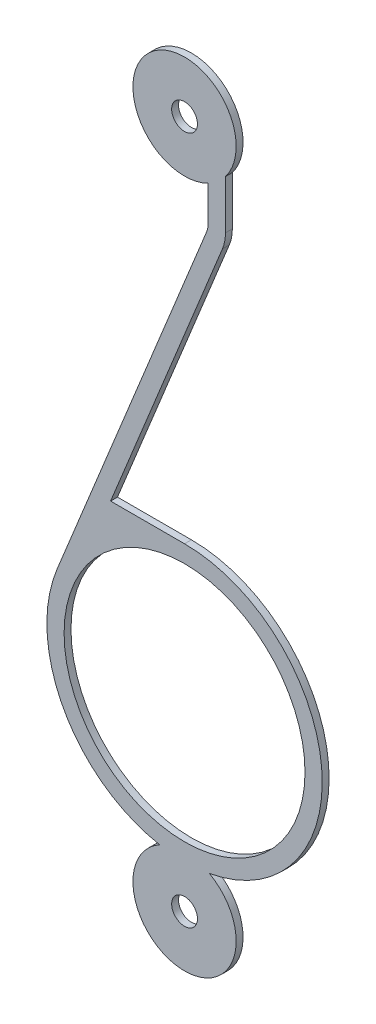
ISO-10303-21;
HEADER;
FILE_DESCRIPTION(('STEP AP214'),'2;1');
FILE_NAME('part.step','',(''),(''),'','','');
FILE_SCHEMA(('AUTOMOTIVE_DESIGN { 1 0 10303 214 1 1 1 1 }'));
ENDSEC;
DATA;
#1=APPLICATION_CONTEXT('core data for automotive mechanical design processes');
#2=APPLICATION_PROTOCOL_DEFINITION('international standard','automotive_design',2000,#1);
#3=PRODUCT_CONTEXT('',#1,'mechanical');
#4=PRODUCT('Part','Part','',(#3));
#5=PRODUCT_RELATED_PRODUCT_CATEGORY('part','',(#4));
#6=PRODUCT_DEFINITION_FORMATION('','',#4);
#7=PRODUCT_DEFINITION_CONTEXT('part definition',#1,'design');
#8=PRODUCT_DEFINITION('design','',#6,#7);
#9=PRODUCT_DEFINITION_SHAPE('','',#8);
#10=(LENGTH_UNIT() NAMED_UNIT(*) SI_UNIT(.MILLI.,.METRE.));
#11=(NAMED_UNIT(*) PLANE_ANGLE_UNIT() SI_UNIT($,.RADIAN.));
#12=(NAMED_UNIT(*) SI_UNIT($,.STERADIAN.) SOLID_ANGLE_UNIT());
#13=UNCERTAINTY_MEASURE_WITH_UNIT(LENGTH_MEASURE(1.E-05),#10,'distance_accuracy_value','');
#14=(GEOMETRIC_REPRESENTATION_CONTEXT(3) GLOBAL_UNCERTAINTY_ASSIGNED_CONTEXT((#13)) GLOBAL_UNIT_ASSIGNED_CONTEXT((#10,
#11,#12)) REPRESENTATION_CONTEXT('',''));
#15=CARTESIAN_POINT('',(0.,0.,0.));
#16=DIRECTION('',(0.,0.,1.));
#17=DIRECTION('',(1.,0.,0.));
#18=AXIS2_PLACEMENT_3D('',#15,#16,#17);
#19=CARTESIAN_POINT('',(0.,-4.75,0.1));
#20=DIRECTION('',(0.,0.,1.));
#21=DIRECTION('',(1.,0.,0.));
#22=AXIS2_PLACEMENT_3D('',#19,#20,#21);
#23=PLANE('',#22);
#24=CARTESIAN_POINT('',(0.,-10.,0.1));
#25=DIRECTION('',(0.,0.,1.));
#26=DIRECTION('',(1.,0.,0.));
#27=AXIS2_PLACEMENT_3D('',#24,#25,#26);
#28=CIRCLE('',#27,0.375);
#29=CARTESIAN_POINT('',(0.375000000000006,-10.,0.1));
#30=VERTEX_POINT('',#29);
#31=EDGE_CURVE('E273',#30,#30,#28,.T.);
#32=ORIENTED_EDGE('',*,*,#31,.F.);
#33=EDGE_LOOP('',(#32));
#34=FACE_BOUND('',#33,.T.);
#35=CARTESIAN_POINT('',(0.,-4.75,0.1));
#36=DIRECTION('',(0.,0.,1.));
#37=DIRECTION('',(1.,0.,0.));
#38=AXIS2_PLACEMENT_3D('',#35,#36,#37);
#39=CIRCLE('',#38,4.);
#40=CARTESIAN_POINT('',(0.720779017653994,-8.68452380952381,0.1));
#41=VERTEX_POINT('',#40);
#42=CARTESIAN_POINT('',(0.,-0.750000000000003,0.1));
#43=VERTEX_POINT('',#42);
#44=EDGE_CURVE('E170',#41,#43,#39,.T.);
#45=ORIENTED_EDGE('',*,*,#44,.T.);
#46=DIRECTION('',(-1.,0.,0.));
#47=VECTOR('',#46,1.);
#48=CARTESIAN_POINT('',(0.,-0.750000000000003,0.1));
#49=LINE('',#48,#47);
#50=CARTESIAN_POINT('',(-2.14896592734822,-0.750000000000002,0.1));
#51=VERTEX_POINT('',#50);
#52=EDGE_CURVE('E103',#43,#51,#49,.T.);
#53=ORIENTED_EDGE('',*,*,#52,.T.);
#54=DIRECTION('',(0.377511829712746,0.926004761557377,0.));
#55=VECTOR('',#54,1.);
#56=CARTESIAN_POINT('',(1.09963065434939,7.21853413923477,0.1));
#57=LINE('',#56,#55);
#58=CARTESIAN_POINT('',(1.09963065434939,7.21853413923477,0.1));
#59=VERTEX_POINT('',#58);
#60=EDGE_CURVE('E194',#51,#59,#57,.T.);
#61=ORIENTED_EDGE('',*,*,#60,.T.);
#62=CARTESIAN_POINT('',(0.,7.66682943701865,0.1));
#63=DIRECTION('',(0.,0.,1.));
#64=DIRECTION('',(-1.,0.,0.));
#65=AXIS2_PLACEMENT_3D('',#62,#63,#64);
#66=CIRCLE('',#65,1.1875);
#67=CARTESIAN_POINT('',(1.1875,7.66682943701865,0.1));
#68=VERTEX_POINT('',#67);
#69=EDGE_CURVE('E213',#59,#68,#66,.T.);
#70=ORIENTED_EDGE('',*,*,#69,.T.);
#71=DIRECTION('',(0.,1.,0.));
#72=VECTOR('',#71,1.);
#73=CARTESIAN_POINT('',(1.1875,7.66682943701865,0.1));
#74=LINE('',#73,#72);
#75=CARTESIAN_POINT('',(1.1875,9.08357010633655,0.1));
#76=VERTEX_POINT('',#75);
#77=EDGE_CURVE('E210',#68,#76,#74,.T.);
#78=ORIENTED_EDGE('',*,*,#77,.T.);
#79=CARTESIAN_POINT('',(0.,10.,0.1));
#80=DIRECTION('',(0.,0.,1.));
#81=DIRECTION('',(1.,0.,0.));
#82=AXIS2_PLACEMENT_3D('',#79,#80,#81);
#83=CIRCLE('',#82,1.5);
#84=CARTESIAN_POINT('',(0.6875,8.66682943701865,0.1));
#85=VERTEX_POINT('',#84);
#86=EDGE_CURVE('E212',#76,#85,#83,.T.);
#87=ORIENTED_EDGE('',*,*,#86,.T.);
#88=DIRECTION('',(0.,-1.,0.));
#89=VECTOR('',#88,1.);
#90=CARTESIAN_POINT('',(0.6875,7.66682943701865,0.1));
#91=LINE('',#90,#89);
#92=CARTESIAN_POINT('',(0.6875,7.66682943701865,0.1));
#93=VERTEX_POINT('',#92);
#94=EDGE_CURVE('E215',#85,#93,#91,.T.);
#95=ORIENTED_EDGE('',*,*,#94,.T.);
#96=CARTESIAN_POINT('',(0.,7.66682943701865,0.1));
#97=DIRECTION('',(0.,0.,-1.));
#98=DIRECTION('',(-1.,0.,0.));
#99=AXIS2_PLACEMENT_3D('',#96,#97,#98);
#100=CIRCLE('',#99,0.6875);
#101=CARTESIAN_POINT('',(0.636628273570696,7.40729005409114,0.1));
#102=VERTEX_POINT('',#101);
#103=EDGE_CURVE('E131',#93,#102,#100,.T.);
#104=ORIENTED_EDGE('',*,*,#103,.T.);
#105=DIRECTION('',(-0.377511829712746,-0.926004761557377,0.));
#106=VECTOR('',#105,1.);
#107=CARTESIAN_POINT('',(0.636628273570696,7.40729005409114,0.1));
#108=LINE('',#107,#106);
#109=CARTESIAN_POINT('',(-3.7040190462295,-3.23995268114902,0.1));
#110=VERTEX_POINT('',#109);
#111=EDGE_CURVE('E125',#102,#110,#108,.T.);
#112=ORIENTED_EDGE('',*,*,#111,.T.);
#113=CARTESIAN_POINT('',(0.,-4.75,0.1));
#114=DIRECTION('',(0.,0.,1.));
#115=DIRECTION('',(1.,0.,0.));
#116=AXIS2_PLACEMENT_3D('',#113,#114,#115);
#117=CIRCLE('',#116,4.);
#118=CARTESIAN_POINT('',(-0.720779017653985,-8.68452380952381,0.1));
#119=VERTEX_POINT('',#118);
#120=EDGE_CURVE('E129',#110,#119,#117,.T.);
#121=ORIENTED_EDGE('',*,*,#120,.T.);
#122=CARTESIAN_POINT('',(0.,-10.,0.1));
#123=DIRECTION('',(0.,0.,1.));
#124=DIRECTION('',(1.,0.,0.));
#125=AXIS2_PLACEMENT_3D('',#122,#123,#124);
#126=CIRCLE('',#125,1.5);
#127=EDGE_CURVE('E51',#119,#41,#126,.T.);
#128=ORIENTED_EDGE('',*,*,#127,.T.);
#129=EDGE_LOOP('',(#45,#53,#61,#70,#78,#87,#95,#104,#112,#121,#128));
#130=FACE_BOUND('',#129,.T.);
#131=CARTESIAN_POINT('',(0.,10.,0.1));
#132=DIRECTION('',(0.,0.,1.));
#133=DIRECTION('',(1.,0.,0.));
#134=AXIS2_PLACEMENT_3D('',#131,#132,#133);
#135=CIRCLE('',#134,0.375000000000001);
#136=CARTESIAN_POINT('',(0.375000000000001,10.,0.1));
#137=VERTEX_POINT('',#136);
#138=EDGE_CURVE('E153',#137,#137,#135,.T.);
#139=ORIENTED_EDGE('',*,*,#138,.F.);
#140=EDGE_LOOP('',(#139));
#141=FACE_BOUND('',#140,.T.);
#142=CARTESIAN_POINT('',(0.,-4.75,0.1));
#143=DIRECTION('',(0.,0.,1.));
#144=DIRECTION('',(1.,0.,0.));
#145=AXIS2_PLACEMENT_3D('',#142,#143,#144);
#146=CIRCLE('',#145,3.5);
#147=CARTESIAN_POINT('',(3.5,-4.75,0.1));
#148=VERTEX_POINT('',#147);
#149=EDGE_CURVE('E264',#148,#148,#146,.T.);
#150=ORIENTED_EDGE('',*,*,#149,.F.);
#151=EDGE_LOOP('',(#150));
#152=FACE_BOUND('',#151,.T.);
#153=ADVANCED_FACE('F34',(#34,#130,#141,#152),#23,.T.);
#154=CARTESIAN_POINT('',(0.,-4.75,-0.1));
#155=DIRECTION('',(0.,0.,1.));
#156=DIRECTION('',(1.,0.,0.));
#157=AXIS2_PLACEMENT_3D('',#154,#155,#156);
#158=PLANE('',#157);
#159=CARTESIAN_POINT('',(0.,-4.75,-0.1));
#160=DIRECTION('',(0.,0.,1.));
#161=DIRECTION('',(1.,0.,0.));
#162=AXIS2_PLACEMENT_3D('',#159,#160,#161);
#163=CIRCLE('',#162,4.);
#164=CARTESIAN_POINT('',(0.720779017653994,-8.68452380952381,-0.1));
#165=VERTEX_POINT('',#164);
#166=CARTESIAN_POINT('',(0.,-0.750000000000003,-0.1));
#167=VERTEX_POINT('',#166);
#168=EDGE_CURVE('E149',#165,#167,#163,.T.);
#169=ORIENTED_EDGE('',*,*,#168,.F.);
#170=CARTESIAN_POINT('',(0.,-10.,-0.1));
#171=DIRECTION('',(0.,0.,1.));
#172=DIRECTION('',(1.,0.,0.));
#173=AXIS2_PLACEMENT_3D('',#170,#171,#172);
#174=CIRCLE('',#173,1.5);
#175=CARTESIAN_POINT('',(-0.720779017653985,-8.68452380952381,-0.1));
#176=VERTEX_POINT('',#175);
#177=EDGE_CURVE('E95',#176,#165,#174,.T.);
#178=ORIENTED_EDGE('',*,*,#177,.F.);
#179=CARTESIAN_POINT('',(0.,-4.75,-0.1));
#180=DIRECTION('',(0.,0.,1.));
#181=DIRECTION('',(1.,0.,0.));
#182=AXIS2_PLACEMENT_3D('',#179,#180,#181);
#183=CIRCLE('',#182,4.);
#184=CARTESIAN_POINT('',(-3.7040190462295,-3.23995268114902,-0.1));
#185=VERTEX_POINT('',#184);
#186=EDGE_CURVE('E89',#185,#176,#183,.T.);
#187=ORIENTED_EDGE('',*,*,#186,.F.);
#188=DIRECTION('',(-0.377511829712746,-0.926004761557377,0.));
#189=VECTOR('',#188,1.);
#190=CARTESIAN_POINT('',(0.636628273570696,7.40729005409114,-0.1));
#191=LINE('',#190,#189);
#192=CARTESIAN_POINT('',(0.636628273570696,7.40729005409114,-0.1));
#193=VERTEX_POINT('',#192);
#194=EDGE_CURVE('E139',#193,#185,#191,.T.);
#195=ORIENTED_EDGE('',*,*,#194,.F.);
#196=CARTESIAN_POINT('',(0.,7.66682943701865,-0.1));
#197=DIRECTION('',(0.,0.,-1.));
#198=DIRECTION('',(-1.,0.,0.));
#199=AXIS2_PLACEMENT_3D('',#196,#197,#198);
#200=CIRCLE('',#199,0.6875);
#201=CARTESIAN_POINT('',(0.6875,7.66682943701865,-0.1));
#202=VERTEX_POINT('',#201);
#203=EDGE_CURVE('E165',#202,#193,#200,.T.);
#204=ORIENTED_EDGE('',*,*,#203,.F.);
#205=DIRECTION('',(0.,-1.,0.));
#206=VECTOR('',#205,1.);
#207=CARTESIAN_POINT('',(0.6875,7.66682943701865,-0.1));
#208=LINE('',#207,#206);
#209=CARTESIAN_POINT('',(0.6875,8.66682943701865,-0.1));
#210=VERTEX_POINT('',#209);
#211=EDGE_CURVE('E163',#210,#202,#208,.T.);
#212=ORIENTED_EDGE('',*,*,#211,.F.);
#213=CARTESIAN_POINT('',(0.,10.,-0.1));
#214=DIRECTION('',(0.,0.,1.));
#215=DIRECTION('',(1.,0.,0.));
#216=AXIS2_PLACEMENT_3D('',#213,#214,#215);
#217=CIRCLE('',#216,1.5);
#218=CARTESIAN_POINT('',(1.1875,9.08357010633655,-0.1));
#219=VERTEX_POINT('',#218);
#220=EDGE_CURVE('E161',#219,#210,#217,.T.);
#221=ORIENTED_EDGE('',*,*,#220,.F.);
#222=DIRECTION('',(0.,1.,0.));
#223=VECTOR('',#222,1.);
#224=CARTESIAN_POINT('',(1.1875,7.66682943701865,-0.1));
#225=LINE('',#224,#223);
#226=CARTESIAN_POINT('',(1.1875,7.66682943701865,-0.1));
#227=VERTEX_POINT('',#226);
#228=EDGE_CURVE('E159',#227,#219,#225,.T.);
#229=ORIENTED_EDGE('',*,*,#228,.F.);
#230=CARTESIAN_POINT('',(0.,7.66682943701865,-0.1));
#231=DIRECTION('',(0.,0.,1.));
#232=DIRECTION('',(-1.,0.,0.));
#233=AXIS2_PLACEMENT_3D('',#230,#231,#232);
#234=CIRCLE('',#233,1.1875);
#235=CARTESIAN_POINT('',(1.09963065434939,7.21853413923477,-0.1));
#236=VERTEX_POINT('',#235);
#237=EDGE_CURVE('E157',#236,#227,#234,.T.);
#238=ORIENTED_EDGE('',*,*,#237,.F.);
#239=DIRECTION('',(0.377511829712746,0.926004761557377,0.));
#240=VECTOR('',#239,1.);
#241=CARTESIAN_POINT('',(1.09963065434939,7.21853413923477,-0.1));
#242=LINE('',#241,#240);
#243=CARTESIAN_POINT('',(-2.14896592734822,-0.750000000000002,-0.1));
#244=VERTEX_POINT('',#243);
#245=EDGE_CURVE('E155',#244,#236,#242,.T.);
#246=ORIENTED_EDGE('',*,*,#245,.F.);
#247=DIRECTION('',(-1.,0.,0.));
#248=VECTOR('',#247,1.);
#249=CARTESIAN_POINT('',(0.,-0.750000000000003,-0.1));
#250=LINE('',#249,#248);
#251=EDGE_CURVE('E152',#167,#244,#250,.T.);
#252=ORIENTED_EDGE('',*,*,#251,.F.);
#253=EDGE_LOOP('',(#169,#178,#187,#195,#204,#212,#221,#229,#238,#246,#252));
#254=FACE_BOUND('',#253,.T.);
#255=CARTESIAN_POINT('',(0.,10.,-0.1));
#256=DIRECTION('',(0.,0.,1.));
#257=DIRECTION('',(1.,0.,0.));
#258=AXIS2_PLACEMENT_3D('',#255,#256,#257);
#259=CIRCLE('',#258,0.375000000000001);
#260=CARTESIAN_POINT('',(0.375000000000001,10.,-0.1));
#261=VERTEX_POINT('',#260);
#262=EDGE_CURVE('E276',#261,#261,#259,.T.);
#263=ORIENTED_EDGE('',*,*,#262,.T.);
#264=EDGE_LOOP('',(#263));
#265=FACE_BOUND('',#264,.T.);
#266=CARTESIAN_POINT('',(0.,-10.,-0.1));
#267=DIRECTION('',(0.,0.,1.));
#268=DIRECTION('',(1.,0.,0.));
#269=AXIS2_PLACEMENT_3D('',#266,#267,#268);
#270=CIRCLE('',#269,0.375);
#271=CARTESIAN_POINT('',(0.375000000000006,-10.,-0.1));
#272=VERTEX_POINT('',#271);
#273=EDGE_CURVE('E270',#272,#272,#270,.T.);
#274=ORIENTED_EDGE('',*,*,#273,.T.);
#275=EDGE_LOOP('',(#274));
#276=FACE_BOUND('',#275,.T.);
#277=CARTESIAN_POINT('',(0.,-4.75,-0.1));
#278=DIRECTION('',(0.,0.,1.));
#279=DIRECTION('',(1.,0.,0.));
#280=AXIS2_PLACEMENT_3D('',#277,#278,#279);
#281=CIRCLE('',#280,3.5);
#282=CARTESIAN_POINT('',(3.5,-4.75,-0.1));
#283=VERTEX_POINT('',#282);
#284=EDGE_CURVE('E267',#283,#283,#281,.T.);
#285=ORIENTED_EDGE('',*,*,#284,.T.);
#286=EDGE_LOOP('',(#285));
#287=FACE_BOUND('',#286,.T.);
#288=ADVANCED_FACE('F198',(#254,#265,#276,#287),#158,.F.);
#289=CARTESIAN_POINT('',(0.,-4.75,0.1));
#290=DIRECTION('',(0.,0.,-1.));
#291=DIRECTION('',(-1.,0.,0.));
#292=AXIS2_PLACEMENT_3D('',#289,#290,#291);
#293=CYLINDRICAL_SURFACE('',#292,4.);
#294=ORIENTED_EDGE('',*,*,#168,.T.);
#295=DIRECTION('',(0.,0.,-1.));
#296=VECTOR('',#295,1.);
#297=CARTESIAN_POINT('',(0.,-0.750000000000003,0.1));
#298=LINE('',#297,#296);
#299=EDGE_CURVE('E11',#43,#167,#298,.T.);
#300=ORIENTED_EDGE('',*,*,#299,.F.);
#301=ORIENTED_EDGE('',*,*,#44,.F.);
#302=DIRECTION('',(0.,0.,-1.));
#303=VECTOR('',#302,1.);
#304=CARTESIAN_POINT('',(0.720779017653994,-8.68452380952381,0.1));
#305=LINE('',#304,#303);
#306=EDGE_CURVE('E145',#41,#165,#305,.T.);
#307=ORIENTED_EDGE('',*,*,#306,.T.);
#308=EDGE_LOOP('',(#294,#300,#301,#307));
#309=FACE_BOUND('',#308,.T.);
#310=ADVANCED_FACE('F36',(#309),#293,.T.);
#311=CARTESIAN_POINT('',(0.,-0.750000000000003,0.1));
#312=DIRECTION('',(0.,-1.,0.));
#313=DIRECTION('',(1.,0.,0.));
#314=AXIS2_PLACEMENT_3D('',#311,#312,#313);
#315=PLANE('',#314);
#316=ORIENTED_EDGE('',*,*,#251,.T.);
#317=DIRECTION('',(0.,0.,-1.));
#318=VECTOR('',#317,1.);
#319=CARTESIAN_POINT('',(-2.14896592734822,-0.750000000000002,0.1));
#320=LINE('',#319,#318);
#321=EDGE_CURVE('E43',#51,#244,#320,.T.);
#322=ORIENTED_EDGE('',*,*,#321,.F.);
#323=ORIENTED_EDGE('',*,*,#52,.F.);
#324=ORIENTED_EDGE('',*,*,#299,.T.);
#325=EDGE_LOOP('',(#316,#322,#323,#324));
#326=FACE_BOUND('',#325,.T.);
#327=ADVANCED_FACE('F368',(#326),#315,.F.);
#328=CARTESIAN_POINT('',(1.09963065434939,7.21853413923477,0.1));
#329=DIRECTION('',(-0.926004761557377,0.377511829712746,0.));
#330=DIRECTION('',(-0.377511829712746,-0.926004761557377,0.));
#331=AXIS2_PLACEMENT_3D('',#328,#329,#330);
#332=PLANE('',#331);
#333=ORIENTED_EDGE('',*,*,#245,.T.);
#334=DIRECTION('',(0.,0.,-1.));
#335=VECTOR('',#334,1.);
#336=CARTESIAN_POINT('',(1.09963065434939,7.21853413923477,0.1));
#337=LINE('',#336,#335);
#338=EDGE_CURVE('E186',#59,#236,#337,.T.);
#339=ORIENTED_EDGE('',*,*,#338,.F.);
#340=ORIENTED_EDGE('',*,*,#60,.F.);
#341=ORIENTED_EDGE('',*,*,#321,.T.);
#342=EDGE_LOOP('',(#333,#339,#340,#341));
#343=FACE_BOUND('',#342,.T.);
#344=ADVANCED_FACE('F192',(#343),#332,.F.);
#345=CARTESIAN_POINT('',(0.,7.66682943701865,0.1));
#346=DIRECTION('',(0.,0.,-1.));
#347=DIRECTION('',(-1.,0.,0.));
#348=AXIS2_PLACEMENT_3D('',#345,#346,#347);
#349=CYLINDRICAL_SURFACE('',#348,1.1875);
#350=ORIENTED_EDGE('',*,*,#237,.T.);
#351=DIRECTION('',(0.,0.,-1.));
#352=VECTOR('',#351,1.);
#353=CARTESIAN_POINT('',(1.1875,7.66682943701865,0.1));
#354=LINE('',#353,#352);
#355=EDGE_CURVE('E183',#68,#227,#354,.T.);
#356=ORIENTED_EDGE('',*,*,#355,.F.);
#357=ORIENTED_EDGE('',*,*,#69,.F.);
#358=ORIENTED_EDGE('',*,*,#338,.T.);
#359=EDGE_LOOP('',(#350,#356,#357,#358));
#360=FACE_BOUND('',#359,.T.);
#361=ADVANCED_FACE('F204',(#360),#349,.T.);
#362=CARTESIAN_POINT('',(1.1875,7.66682943701865,0.1));
#363=DIRECTION('',(-1.,0.,0.));
#364=DIRECTION('',(0.,0.,1.));
#365=AXIS2_PLACEMENT_3D('',#362,#363,#364);
#366=PLANE('',#365);
#367=ORIENTED_EDGE('',*,*,#228,.T.);
#368=DIRECTION('',(0.,0.,-1.));
#369=VECTOR('',#368,1.);
#370=CARTESIAN_POINT('',(1.1875,9.08357010633655,0.1));
#371=LINE('',#370,#369);
#372=EDGE_CURVE('E180',#76,#219,#371,.T.);
#373=ORIENTED_EDGE('',*,*,#372,.F.);
#374=ORIENTED_EDGE('',*,*,#77,.F.);
#375=ORIENTED_EDGE('',*,*,#355,.T.);
#376=EDGE_LOOP('',(#367,#373,#374,#375));
#377=FACE_BOUND('',#376,.T.);
#378=ADVANCED_FACE('F208',(#377),#366,.F.);
#379=CARTESIAN_POINT('',(0.,10.,0.1));
#380=DIRECTION('',(0.,0.,-1.));
#381=DIRECTION('',(-1.,0.,0.));
#382=AXIS2_PLACEMENT_3D('',#379,#380,#381);
#383=CYLINDRICAL_SURFACE('',#382,1.5);
#384=ORIENTED_EDGE('',*,*,#220,.T.);
#385=DIRECTION('',(0.,0.,-1.));
#386=VECTOR('',#385,1.);
#387=CARTESIAN_POINT('',(0.6875,8.66682943701865,0.1));
#388=LINE('',#387,#386);
#389=EDGE_CURVE('E177',#85,#210,#388,.T.);
#390=ORIENTED_EDGE('',*,*,#389,.F.);
#391=ORIENTED_EDGE('',*,*,#86,.F.);
#392=ORIENTED_EDGE('',*,*,#372,.T.);
#393=EDGE_LOOP('',(#384,#390,#391,#392));
#394=FACE_BOUND('',#393,.T.);
#395=ADVANCED_FACE('F334',(#394),#383,.T.);
#396=CARTESIAN_POINT('',(0.6875,7.66682943701865,0.1));
#397=DIRECTION('',(1.,0.,0.));
#398=DIRECTION('',(0.,1.,0.));
#399=AXIS2_PLACEMENT_3D('',#396,#397,#398);
#400=PLANE('',#399);
#401=ORIENTED_EDGE('',*,*,#211,.T.);
#402=DIRECTION('',(0.,0.,-1.));
#403=VECTOR('',#402,1.);
#404=CARTESIAN_POINT('',(0.6875,7.66682943701865,0.1));
#405=LINE('',#404,#403);
#406=EDGE_CURVE('E174',#93,#202,#405,.T.);
#407=ORIENTED_EDGE('',*,*,#406,.F.);
#408=ORIENTED_EDGE('',*,*,#94,.F.);
#409=ORIENTED_EDGE('',*,*,#389,.T.);
#410=EDGE_LOOP('',(#401,#407,#408,#409));
#411=FACE_BOUND('',#410,.T.);
#412=ADVANCED_FACE('F224',(#411),#400,.F.);
#413=CARTESIAN_POINT('',(0.,7.66682943701865,0.1));
#414=DIRECTION('',(0.,0.,-1.));
#415=DIRECTION('',(-1.,0.,0.));
#416=AXIS2_PLACEMENT_3D('',#413,#414,#415);
#417=CYLINDRICAL_SURFACE('',#416,0.6875);
#418=ORIENTED_EDGE('',*,*,#203,.T.);
#419=DIRECTION('',(0.,0.,-1.));
#420=VECTOR('',#419,1.);
#421=CARTESIAN_POINT('',(0.636628273570696,7.40729005409114,0.1));
#422=LINE('',#421,#420);
#423=EDGE_CURVE('E140',#102,#193,#422,.T.);
#424=ORIENTED_EDGE('',*,*,#423,.F.);
#425=ORIENTED_EDGE('',*,*,#103,.F.);
#426=ORIENTED_EDGE('',*,*,#406,.T.);
#427=EDGE_LOOP('',(#418,#424,#425,#426));
#428=FACE_BOUND('',#427,.T.);
#429=ADVANCED_FACE('F228',(#428),#417,.F.);
#430=CARTESIAN_POINT('',(0.636628273570696,7.40729005409114,0.1));
#431=DIRECTION('',(0.926004761557377,-0.377511829712746,0.));
#432=DIRECTION('',(0.377511829712746,0.926004761557377,0.));
#433=AXIS2_PLACEMENT_3D('',#430,#431,#432);
#434=PLANE('',#433);
#435=ORIENTED_EDGE('',*,*,#194,.T.);
#436=DIRECTION('',(0.,0.,-1.));
#437=VECTOR('',#436,1.);
#438=CARTESIAN_POINT('',(-3.7040190462295,-3.23995268114902,0.1));
#439=LINE('',#438,#437);
#440=EDGE_CURVE('E136',#110,#185,#439,.T.);
#441=ORIENTED_EDGE('',*,*,#440,.F.);
#442=ORIENTED_EDGE('',*,*,#111,.F.);
#443=ORIENTED_EDGE('',*,*,#423,.T.);
#444=EDGE_LOOP('',(#435,#441,#442,#443));
#445=FACE_BOUND('',#444,.T.);
#446=ADVANCED_FACE('F137',(#445),#434,.F.);
#447=CARTESIAN_POINT('',(0.,-4.75,0.1));
#448=DIRECTION('',(0.,0.,-1.));
#449=DIRECTION('',(-1.,0.,0.));
#450=AXIS2_PLACEMENT_3D('',#447,#448,#449);
#451=CYLINDRICAL_SURFACE('',#450,4.);
#452=ORIENTED_EDGE('',*,*,#186,.T.);
#453=DIRECTION('',(0.,0.,-1.));
#454=VECTOR('',#453,1.);
#455=CARTESIAN_POINT('',(-0.720779017653985,-8.68452380952381,0.1));
#456=LINE('',#455,#454);
#457=EDGE_CURVE('E141',#119,#176,#456,.T.);
#458=ORIENTED_EDGE('',*,*,#457,.F.);
#459=ORIENTED_EDGE('',*,*,#120,.F.);
#460=ORIENTED_EDGE('',*,*,#440,.T.);
#461=EDGE_LOOP('',(#452,#458,#459,#460));
#462=FACE_BOUND('',#461,.T.);
#463=ADVANCED_FACE('F143',(#462),#451,.T.);
#464=CARTESIAN_POINT('',(0.,-10.,0.1));
#465=DIRECTION('',(0.,0.,-1.));
#466=DIRECTION('',(-1.,0.,0.));
#467=AXIS2_PLACEMENT_3D('',#464,#465,#466);
#468=CYLINDRICAL_SURFACE('',#467,1.5);
#469=ORIENTED_EDGE('',*,*,#177,.T.);
#470=ORIENTED_EDGE('',*,*,#306,.F.);
#471=ORIENTED_EDGE('',*,*,#127,.F.);
#472=ORIENTED_EDGE('',*,*,#457,.T.);
#473=EDGE_LOOP('',(#469,#470,#471,#472));
#474=FACE_BOUND('',#473,.T.);
#475=ADVANCED_FACE('F232',(#474),#468,.T.);
#476=CARTESIAN_POINT('',(0.,10.,0.1));
#477=DIRECTION('',(0.,0.,-1.));
#478=DIRECTION('',(-1.,0.,0.));
#479=AXIS2_PLACEMENT_3D('',#476,#477,#478);
#480=CYLINDRICAL_SURFACE('',#479,0.375000000000001);
#481=ORIENTED_EDGE('',*,*,#138,.T.);
#482=EDGE_LOOP('',(#481));
#483=FACE_BOUND('',#482,.T.);
#484=ORIENTED_EDGE('',*,*,#262,.F.);
#485=EDGE_LOOP('',(#484));
#486=FACE_BOUND('',#485,.T.);
#487=ADVANCED_FACE('F234',(#483,#486),#480,.F.);
#488=CARTESIAN_POINT('',(0.,-10.,0.1));
#489=DIRECTION('',(0.,0.,-1.));
#490=DIRECTION('',(-1.,0.,0.));
#491=AXIS2_PLACEMENT_3D('',#488,#489,#490);
#492=CYLINDRICAL_SURFACE('',#491,0.375);
#493=ORIENTED_EDGE('',*,*,#31,.T.);
#494=EDGE_LOOP('',(#493));
#495=FACE_BOUND('',#494,.T.);
#496=ORIENTED_EDGE('',*,*,#273,.F.);
#497=EDGE_LOOP('',(#496));
#498=FACE_BOUND('',#497,.T.);
#499=ADVANCED_FACE('F240',(#495,#498),#492,.F.);
#500=CARTESIAN_POINT('',(0.,-4.75,0.1));
#501=DIRECTION('',(0.,0.,-1.));
#502=DIRECTION('',(-1.,0.,0.));
#503=AXIS2_PLACEMENT_3D('',#500,#501,#502);
#504=CYLINDRICAL_SURFACE('',#503,3.5);
#505=ORIENTED_EDGE('',*,*,#149,.T.);
#506=EDGE_LOOP('',(#505));
#507=FACE_BOUND('',#506,.T.);
#508=ORIENTED_EDGE('',*,*,#284,.F.);
#509=EDGE_LOOP('',(#508));
#510=FACE_BOUND('',#509,.T.);
#511=ADVANCED_FACE('F255',(#507,#510),#504,.F.);
#512=CLOSED_SHELL('',(#153,#288,#310,#327,#344,#361,#378,#395,#412,#429,#446,#463,#475,#487,
#499,#511));
#513=MANIFOLD_SOLID_BREP('B2',#512);
#514=ADVANCED_BREP_SHAPE_REPRESENTATION('',(#18,#513),#14);
#515=SHAPE_DEFINITION_REPRESENTATION(#9,#514);
ENDSEC;
END-ISO-10303-21;
